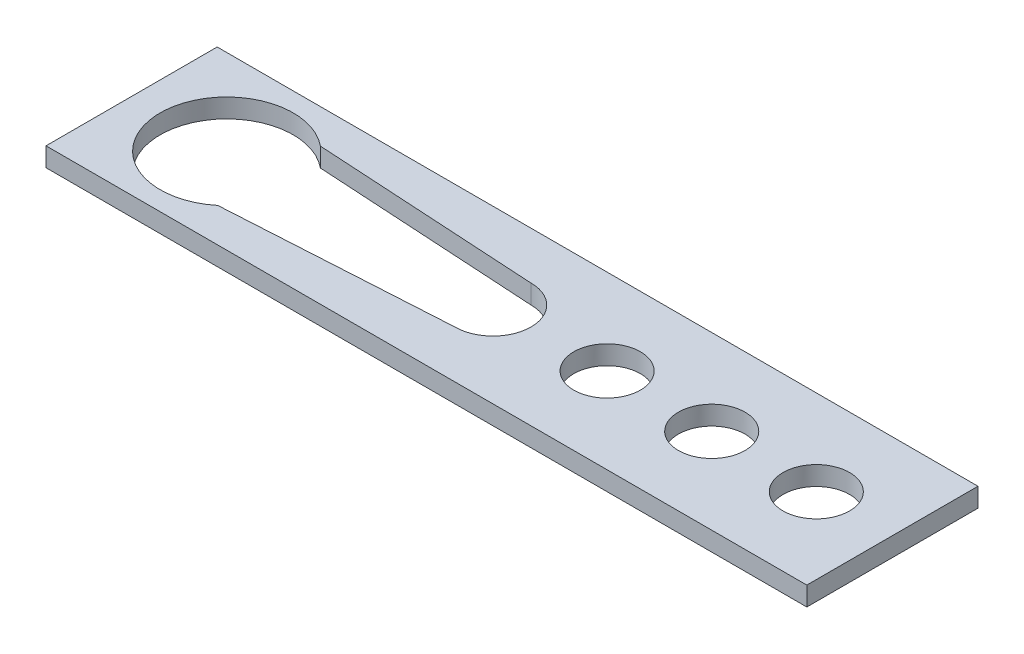
ISO-10303-21;
HEADER;
FILE_DESCRIPTION(('STEP AP214'),'2;1');
FILE_NAME('part.step','',(''),(''),'','','');
FILE_SCHEMA(('AUTOMOTIVE_DESIGN { 1 0 10303 214 1 1 1 1 }'));
ENDSEC;
DATA;
#1=APPLICATION_CONTEXT('core data for automotive mechanical design processes');
#2=APPLICATION_PROTOCOL_DEFINITION('international standard','automotive_design',2000,#1);
#3=PRODUCT_CONTEXT('',#1,'mechanical');
#4=PRODUCT('Part','Part','',(#3));
#5=PRODUCT_RELATED_PRODUCT_CATEGORY('part','',(#4));
#6=PRODUCT_DEFINITION_FORMATION('','',#4);
#7=PRODUCT_DEFINITION_CONTEXT('part definition',#1,'design');
#8=PRODUCT_DEFINITION('design','',#6,#7);
#9=PRODUCT_DEFINITION_SHAPE('','',#8);
#10=(LENGTH_UNIT() NAMED_UNIT(*) SI_UNIT(.MILLI.,.METRE.));
#11=(NAMED_UNIT(*) PLANE_ANGLE_UNIT() SI_UNIT($,.RADIAN.));
#12=(NAMED_UNIT(*) SI_UNIT($,.STERADIAN.) SOLID_ANGLE_UNIT());
#13=UNCERTAINTY_MEASURE_WITH_UNIT(LENGTH_MEASURE(1.E-05),#10,'distance_accuracy_value','');
#14=(GEOMETRIC_REPRESENTATION_CONTEXT(3) GLOBAL_UNCERTAINTY_ASSIGNED_CONTEXT((#13)) GLOBAL_UNIT_ASSIGNED_CONTEXT((#10,
#11,#12)) REPRESENTATION_CONTEXT('',''));
#15=CARTESIAN_POINT('',(0.,0.,0.));
#16=DIRECTION('',(0.,0.,1.));
#17=DIRECTION('',(1.,0.,0.));
#18=AXIS2_PLACEMENT_3D('',#15,#16,#17);
#19=CARTESIAN_POINT('',(16.,-2.,0.));
#20=DIRECTION('',(0.,1.,0.));
#21=DIRECTION('',(0.,0.,1.));
#22=AXIS2_PLACEMENT_3D('',#19,#20,#21);
#23=CYLINDRICAL_SURFACE('',#22,1.75);
#24=CARTESIAN_POINT('',(16.,0.,0.));
#25=DIRECTION('',(0.,-1.,0.));
#26=DIRECTION('',(0.,0.,-1.));
#27=AXIS2_PLACEMENT_3D('',#24,#25,#26);
#28=CIRCLE('',#27,1.75);
#29=CARTESIAN_POINT('',(16.,0.,-1.75));
#30=VERTEX_POINT('',#29);
#31=EDGE_CURVE('E39',#30,#30,#28,.T.);
#32=ORIENTED_EDGE('',*,*,#31,.T.);
#33=EDGE_LOOP('',(#32));
#34=FACE_BOUND('',#33,.T.);
#35=CARTESIAN_POINT('',(16.,1.,0.));
#36=DIRECTION('',(0.,1.,0.));
#37=DIRECTION('',(0.,0.,1.));
#38=AXIS2_PLACEMENT_3D('',#35,#36,#37);
#39=CIRCLE('',#38,1.75);
#40=CARTESIAN_POINT('',(16.,1.,1.75));
#41=VERTEX_POINT('',#40);
#42=EDGE_CURVE('E11',#41,#41,#39,.T.);
#43=ORIENTED_EDGE('',*,*,#42,.T.);
#44=EDGE_LOOP('',(#43));
#45=FACE_BOUND('',#44,.T.);
#46=ADVANCED_FACE('F32',(#34,#45),#23,.F.);
#47=CARTESIAN_POINT('',(20.,1.,4.5));
#48=DIRECTION('',(-1.,0.,0.));
#49=DIRECTION('',(0.,0.,1.));
#50=AXIS2_PLACEMENT_3D('',#47,#48,#49);
#51=PLANE('',#50);
#52=DIRECTION('',(0.,0.,-1.));
#53=VECTOR('',#52,1.);
#54=CARTESIAN_POINT('',(20.,0.,4.5));
#55=LINE('',#54,#53);
#56=CARTESIAN_POINT('',(20.,0.,4.5));
#57=VERTEX_POINT('',#56);
#58=CARTESIAN_POINT('',(20.,0.,-4.5));
#59=VERTEX_POINT('',#58);
#60=EDGE_CURVE('E122',#57,#59,#55,.T.);
#61=ORIENTED_EDGE('',*,*,#60,.T.);
#62=DIRECTION('',(0.,-1.,0.));
#63=VECTOR('',#62,1.);
#64=CARTESIAN_POINT('',(20.,1.,-4.5));
#65=LINE('',#64,#63);
#66=CARTESIAN_POINT('',(20.,1.,-4.5));
#67=VERTEX_POINT('',#66);
#68=EDGE_CURVE('E151',#67,#59,#65,.T.);
#69=ORIENTED_EDGE('',*,*,#68,.F.);
#70=DIRECTION('',(0.,0.,-1.));
#71=VECTOR('',#70,1.);
#72=CARTESIAN_POINT('',(20.,1.,4.5));
#73=LINE('',#72,#71);
#74=CARTESIAN_POINT('',(20.,1.,4.5));
#75=VERTEX_POINT('',#74);
#76=EDGE_CURVE('E125',#75,#67,#73,.T.);
#77=ORIENTED_EDGE('',*,*,#76,.F.);
#78=DIRECTION('',(0.,-1.,0.));
#79=VECTOR('',#78,1.);
#80=CARTESIAN_POINT('',(20.,1.,4.5));
#81=LINE('',#80,#79);
#82=EDGE_CURVE('E135',#75,#57,#81,.T.);
#83=ORIENTED_EDGE('',*,*,#82,.T.);
#84=EDGE_LOOP('',(#61,#69,#77,#83));
#85=FACE_BOUND('',#84,.T.);
#86=ADVANCED_FACE('F187',(#85),#51,.F.);
#87=CARTESIAN_POINT('',(-20.,1.,-4.5));
#88=DIRECTION('',(0.,0.,1.));
#89=DIRECTION('',(1.,0.,0.));
#90=AXIS2_PLACEMENT_3D('',#87,#88,#89);
#91=PLANE('',#90);
#92=DIRECTION('',(-1.,0.,0.));
#93=VECTOR('',#92,1.);
#94=CARTESIAN_POINT('',(-20.,0.,-4.5));
#95=LINE('',#94,#93);
#96=CARTESIAN_POINT('',(-20.,0.,-4.5));
#97=VERTEX_POINT('',#96);
#98=EDGE_CURVE('E138',#59,#97,#95,.T.);
#99=ORIENTED_EDGE('',*,*,#98,.T.);
#100=DIRECTION('',(0.,-1.,0.));
#101=VECTOR('',#100,1.);
#102=CARTESIAN_POINT('',(-20.,1.,-4.5));
#103=LINE('',#102,#101);
#104=CARTESIAN_POINT('',(-20.,1.,-4.5));
#105=VERTEX_POINT('',#104);
#106=EDGE_CURVE('E148',#105,#97,#103,.T.);
#107=ORIENTED_EDGE('',*,*,#106,.F.);
#108=DIRECTION('',(-1.,0.,0.));
#109=VECTOR('',#108,1.);
#110=CARTESIAN_POINT('',(-20.,1.,-4.5));
#111=LINE('',#110,#109);
#112=EDGE_CURVE('E128',#67,#105,#111,.T.);
#113=ORIENTED_EDGE('',*,*,#112,.F.);
#114=ORIENTED_EDGE('',*,*,#68,.T.);
#115=EDGE_LOOP('',(#99,#107,#113,#114));
#116=FACE_BOUND('',#115,.T.);
#117=ADVANCED_FACE('F191',(#116),#91,.F.);
#118=CARTESIAN_POINT('',(-20.,1.,4.5));
#119=DIRECTION('',(1.,0.,0.));
#120=DIRECTION('',(0.,0.,-1.));
#121=AXIS2_PLACEMENT_3D('',#118,#119,#120);
#122=PLANE('',#121);
#123=DIRECTION('',(0.,0.,1.));
#124=VECTOR('',#123,1.);
#125=CARTESIAN_POINT('',(-20.,0.,4.5));
#126=LINE('',#125,#124);
#127=CARTESIAN_POINT('',(-20.,0.,4.5));
#128=VERTEX_POINT('',#127);
#129=EDGE_CURVE('E140',#97,#128,#126,.T.);
#130=ORIENTED_EDGE('',*,*,#129,.T.);
#131=DIRECTION('',(0.,-1.,0.));
#132=VECTOR('',#131,1.);
#133=CARTESIAN_POINT('',(-20.,1.,4.5));
#134=LINE('',#133,#132);
#135=CARTESIAN_POINT('',(-20.,1.,4.5));
#136=VERTEX_POINT('',#135);
#137=EDGE_CURVE('E145',#136,#128,#134,.T.);
#138=ORIENTED_EDGE('',*,*,#137,.F.);
#139=DIRECTION('',(0.,0.,1.));
#140=VECTOR('',#139,1.);
#141=CARTESIAN_POINT('',(-20.,1.,4.5));
#142=LINE('',#141,#140);
#143=EDGE_CURVE('E131',#105,#136,#142,.T.);
#144=ORIENTED_EDGE('',*,*,#143,.F.);
#145=ORIENTED_EDGE('',*,*,#106,.T.);
#146=EDGE_LOOP('',(#130,#138,#144,#145));
#147=FACE_BOUND('',#146,.T.);
#148=ADVANCED_FACE('F196',(#147),#122,.F.);
#149=CARTESIAN_POINT('',(-20.,1.,4.5));
#150=DIRECTION('',(0.,0.,-1.));
#151=DIRECTION('',(-1.,0.,0.));
#152=AXIS2_PLACEMENT_3D('',#149,#150,#151);
#153=PLANE('',#152);
#154=DIRECTION('',(1.,0.,0.));
#155=VECTOR('',#154,1.);
#156=CARTESIAN_POINT('',(-20.,0.,4.5));
#157=LINE('',#156,#155);
#158=EDGE_CURVE('E129',#128,#57,#157,.T.);
#159=ORIENTED_EDGE('',*,*,#158,.T.);
#160=ORIENTED_EDGE('',*,*,#82,.F.);
#161=DIRECTION('',(1.,0.,0.));
#162=VECTOR('',#161,1.);
#163=CARTESIAN_POINT('',(-20.,1.,4.5));
#164=LINE('',#163,#162);
#165=EDGE_CURVE('E133',#136,#75,#164,.T.);
#166=ORIENTED_EDGE('',*,*,#165,.F.);
#167=ORIENTED_EDGE('',*,*,#137,.T.);
#168=EDGE_LOOP('',(#159,#160,#166,#167));
#169=FACE_BOUND('',#168,.T.);
#170=ADVANCED_FACE('F180',(#169),#153,.F.);
#171=CARTESIAN_POINT('',(0.,1.,0.));
#172=DIRECTION('',(0.,-1.,0.));
#173=DIRECTION('',(0.,0.,-1.));
#174=AXIS2_PLACEMENT_3D('',#171,#172,#173);
#175=PLANE('',#174);
#176=CARTESIAN_POINT('',(10.5,1.,0.));
#177=DIRECTION('',(0.,1.,0.));
#178=DIRECTION('',(0.,0.,1.));
#179=AXIS2_PLACEMENT_3D('',#176,#177,#178);
#180=CIRCLE('',#179,1.75);
#181=CARTESIAN_POINT('',(10.5,1.,1.75));
#182=VERTEX_POINT('',#181);
#183=EDGE_CURVE('E295',#182,#182,#180,.T.);
#184=ORIENTED_EDGE('',*,*,#183,.F.);
#185=EDGE_LOOP('',(#184));
#186=FACE_BOUND('',#185,.T.);
#187=CARTESIAN_POINT('',(5.,1.,0.));
#188=DIRECTION('',(0.,1.,0.));
#189=DIRECTION('',(0.,0.,1.));
#190=AXIS2_PLACEMENT_3D('',#187,#188,#189);
#191=CIRCLE('',#190,1.75);
#192=CARTESIAN_POINT('',(5.,1.,1.75));
#193=VERTEX_POINT('',#192);
#194=EDGE_CURVE('E163',#193,#193,#191,.T.);
#195=ORIENTED_EDGE('',*,*,#194,.F.);
#196=EDGE_LOOP('',(#195));
#197=FACE_BOUND('',#196,.T.);
#198=CARTESIAN_POINT('',(-15.,1.,0.));
#199=DIRECTION('',(0.,1.,0.));
#200=DIRECTION('',(0.,0.,1.));
#201=AXIS2_PLACEMENT_3D('',#198,#199,#200);
#202=CIRCLE('',#201,3.5);
#203=CARTESIAN_POINT('',(-12.772894254868,1.,-2.7));
#204=VERTEX_POINT('',#203);
#205=CARTESIAN_POINT('',(-12.772894254868,1.,2.7));
#206=VERTEX_POINT('',#205);
#207=EDGE_CURVE('E108',#204,#206,#202,.T.);
#208=ORIENTED_EDGE('',*,*,#207,.F.);
#209=DIRECTION('',(-0.998237009670938,0.,-0.0593537911444947));
#210=VECTOR('',#209,1.);
#211=CARTESIAN_POINT('',(0.114975429446203,1.,-1.93370510396884));
#212=LINE('',#211,#210);
#213=CARTESIAN_POINT('',(-0.999999999999999,1.,-2.));
#214=VERTEX_POINT('',#213);
#215=EDGE_CURVE('E46',#214,#204,#212,.T.);
#216=ORIENTED_EDGE('',*,*,#215,.F.);
#217=CARTESIAN_POINT('',(-0.999999999999999,1.,0.));
#218=DIRECTION('',(0.,1.,0.));
#219=DIRECTION('',(0.,0.,1.));
#220=AXIS2_PLACEMENT_3D('',#217,#218,#219);
#221=CIRCLE('',#220,2.);
#222=CARTESIAN_POINT('',(-0.999999999999999,1.,2.));
#223=VERTEX_POINT('',#222);
#224=EDGE_CURVE('E115',#223,#214,#221,.T.);
#225=ORIENTED_EDGE('',*,*,#224,.F.);
#226=DIRECTION('',(0.998237009670938,0.,-0.0593537911444947));
#227=VECTOR('',#226,1.);
#228=CARTESIAN_POINT('',(0.114975429446203,1.,1.93370510396884));
#229=LINE('',#228,#227);
#230=EDGE_CURVE('E99',#206,#223,#229,.T.);
#231=ORIENTED_EDGE('',*,*,#230,.F.);
#232=EDGE_LOOP('',(#208,#216,#225,#231));
#233=FACE_BOUND('',#232,.T.);
#234=ORIENTED_EDGE('',*,*,#76,.T.);
#235=ORIENTED_EDGE('',*,*,#112,.T.);
#236=ORIENTED_EDGE('',*,*,#143,.T.);
#237=ORIENTED_EDGE('',*,*,#165,.T.);
#238=EDGE_LOOP('',(#234,#235,#236,#237));
#239=FACE_BOUND('',#238,.T.);
#240=ORIENTED_EDGE('',*,*,#42,.F.);
#241=EDGE_LOOP('',(#240));
#242=FACE_BOUND('',#241,.T.);
#243=ADVANCED_FACE('F112',(#186,#197,#233,#239,#242),#175,.F.);
#244=CARTESIAN_POINT('',(0.,0.,0.));
#245=DIRECTION('',(0.,-1.,0.));
#246=DIRECTION('',(0.,0.,-1.));
#247=AXIS2_PLACEMENT_3D('',#244,#245,#246);
#248=PLANE('',#247);
#249=CARTESIAN_POINT('',(10.5,0.,0.));
#250=DIRECTION('',(0.,-1.,0.));
#251=DIRECTION('',(0.,0.,-1.));
#252=AXIS2_PLACEMENT_3D('',#249,#250,#251);
#253=CIRCLE('',#252,1.75);
#254=CARTESIAN_POINT('',(10.5,0.,-1.75));
#255=VERTEX_POINT('',#254);
#256=EDGE_CURVE('E298',#255,#255,#253,.T.);
#257=ORIENTED_EDGE('',*,*,#256,.F.);
#258=EDGE_LOOP('',(#257));
#259=FACE_BOUND('',#258,.T.);
#260=CARTESIAN_POINT('',(5.,0.,0.));
#261=DIRECTION('',(0.,-1.,0.));
#262=DIRECTION('',(0.,0.,-1.));
#263=AXIS2_PLACEMENT_3D('',#260,#261,#262);
#264=CIRCLE('',#263,1.75);
#265=CARTESIAN_POINT('',(5.,0.,-1.75));
#266=VERTEX_POINT('',#265);
#267=EDGE_CURVE('E161',#266,#266,#264,.T.);
#268=ORIENTED_EDGE('',*,*,#267,.F.);
#269=EDGE_LOOP('',(#268));
#270=FACE_BOUND('',#269,.T.);
#271=DIRECTION('',(0.998237009670938,0.,0.0593537911444947));
#272=VECTOR('',#271,1.);
#273=CARTESIAN_POINT('',(0.114975429446203,0.,-1.93370510396884));
#274=LINE('',#273,#272);
#275=CARTESIAN_POINT('',(-12.772894254868,0.,-2.7));
#276=VERTEX_POINT('',#275);
#277=CARTESIAN_POINT('',(-0.999999999999999,0.,-2.));
#278=VERTEX_POINT('',#277);
#279=EDGE_CURVE('E159',#276,#278,#274,.T.);
#280=ORIENTED_EDGE('',*,*,#279,.F.);
#281=CARTESIAN_POINT('',(-15.,0.,0.));
#282=DIRECTION('',(0.,-1.,0.));
#283=DIRECTION('',(0.,0.,-1.));
#284=AXIS2_PLACEMENT_3D('',#281,#282,#283);
#285=CIRCLE('',#284,3.5);
#286=CARTESIAN_POINT('',(-12.772894254868,0.,2.7));
#287=VERTEX_POINT('',#286);
#288=EDGE_CURVE('E154',#287,#276,#285,.T.);
#289=ORIENTED_EDGE('',*,*,#288,.F.);
#290=DIRECTION('',(-0.998237009670938,0.,0.0593537911444947));
#291=VECTOR('',#290,1.);
#292=CARTESIAN_POINT('',(0.114975429446203,0.,1.93370510396884));
#293=LINE('',#292,#291);
#294=CARTESIAN_POINT('',(-0.999999999999999,0.,2.));
#295=VERTEX_POINT('',#294);
#296=EDGE_CURVE('E102',#295,#287,#293,.T.);
#297=ORIENTED_EDGE('',*,*,#296,.F.);
#298=CARTESIAN_POINT('',(-0.999999999999999,0.,0.));
#299=DIRECTION('',(0.,-1.,0.));
#300=DIRECTION('',(0.,0.,-1.));
#301=AXIS2_PLACEMENT_3D('',#298,#299,#300);
#302=CIRCLE('',#301,2.);
#303=EDGE_CURVE('E157',#278,#295,#302,.T.);
#304=ORIENTED_EDGE('',*,*,#303,.F.);
#305=EDGE_LOOP('',(#280,#289,#297,#304));
#306=FACE_BOUND('',#305,.T.);
#307=ORIENTED_EDGE('',*,*,#60,.F.);
#308=ORIENTED_EDGE('',*,*,#158,.F.);
#309=ORIENTED_EDGE('',*,*,#129,.F.);
#310=ORIENTED_EDGE('',*,*,#98,.F.);
#311=EDGE_LOOP('',(#307,#308,#309,#310));
#312=FACE_BOUND('',#311,.T.);
#313=ORIENTED_EDGE('',*,*,#31,.F.);
#314=EDGE_LOOP('',(#313));
#315=FACE_BOUND('',#314,.T.);
#316=ADVANCED_FACE('F169',(#259,#270,#306,#312,#315),#248,.T.);
#317=CARTESIAN_POINT('',(0.114975429446203,-2.,-1.93370510396884));
#318=DIRECTION('',(0.0593537911444947,0.,-0.998237009670938));
#319=DIRECTION('',(-0.998237009670938,0.,-0.0593537911444947));
#320=AXIS2_PLACEMENT_3D('',#317,#318,#319);
#321=PLANE('',#320);
#322=ORIENTED_EDGE('',*,*,#279,.T.);
#323=DIRECTION('',(0.,1.,0.));
#324=VECTOR('',#323,1.);
#325=CARTESIAN_POINT('',(-0.999999999999999,-2.,-2.));
#326=LINE('',#325,#324);
#327=EDGE_CURVE('E120',#278,#214,#326,.T.);
#328=ORIENTED_EDGE('',*,*,#327,.T.);
#329=ORIENTED_EDGE('',*,*,#215,.T.);
#330=DIRECTION('',(0.,1.,0.));
#331=VECTOR('',#330,1.);
#332=CARTESIAN_POINT('',(-12.772894254868,-2.,-2.7));
#333=LINE('',#332,#331);
#334=EDGE_CURVE('E105',#276,#204,#333,.T.);
#335=ORIENTED_EDGE('',*,*,#334,.F.);
#336=EDGE_LOOP('',(#322,#328,#329,#335));
#337=FACE_BOUND('',#336,.T.);
#338=ADVANCED_FACE('F171',(#337),#321,.F.);
#339=CARTESIAN_POINT('',(-0.999999999999999,-2.,0.));
#340=DIRECTION('',(0.,1.,0.));
#341=DIRECTION('',(0.,0.,1.));
#342=AXIS2_PLACEMENT_3D('',#339,#340,#341);
#343=CYLINDRICAL_SURFACE('',#342,2.);
#344=ORIENTED_EDGE('',*,*,#303,.T.);
#345=DIRECTION('',(0.,1.,0.));
#346=VECTOR('',#345,1.);
#347=CARTESIAN_POINT('',(-0.999999999999999,-2.,2.));
#348=LINE('',#347,#346);
#349=EDGE_CURVE('E104',#295,#223,#348,.T.);
#350=ORIENTED_EDGE('',*,*,#349,.T.);
#351=ORIENTED_EDGE('',*,*,#224,.T.);
#352=ORIENTED_EDGE('',*,*,#327,.F.);
#353=EDGE_LOOP('',(#344,#350,#351,#352));
#354=FACE_BOUND('',#353,.T.);
#355=ADVANCED_FACE('F178',(#354),#343,.F.);
#356=CARTESIAN_POINT('',(0.114975429446203,-2.,1.93370510396884));
#357=DIRECTION('',(0.0593537911444947,0.,0.998237009670938));
#358=DIRECTION('',(0.998237009670938,0.,-0.0593537911444947));
#359=AXIS2_PLACEMENT_3D('',#356,#357,#358);
#360=PLANE('',#359);
#361=ORIENTED_EDGE('',*,*,#296,.T.);
#362=DIRECTION('',(0.,1.,0.));
#363=VECTOR('',#362,1.);
#364=CARTESIAN_POINT('',(-12.772894254868,-2.,2.7));
#365=LINE('',#364,#363);
#366=EDGE_CURVE('E54',#287,#206,#365,.T.);
#367=ORIENTED_EDGE('',*,*,#366,.T.);
#368=ORIENTED_EDGE('',*,*,#230,.T.);
#369=ORIENTED_EDGE('',*,*,#349,.F.);
#370=EDGE_LOOP('',(#361,#367,#368,#369));
#371=FACE_BOUND('',#370,.T.);
#372=ADVANCED_FACE('F96',(#371),#360,.F.);
#373=CARTESIAN_POINT('',(-15.,-2.,0.));
#374=DIRECTION('',(0.,1.,0.));
#375=DIRECTION('',(0.,0.,1.));
#376=AXIS2_PLACEMENT_3D('',#373,#374,#375);
#377=CYLINDRICAL_SURFACE('',#376,3.5);
#378=ORIENTED_EDGE('',*,*,#288,.T.);
#379=ORIENTED_EDGE('',*,*,#334,.T.);
#380=ORIENTED_EDGE('',*,*,#207,.T.);
#381=ORIENTED_EDGE('',*,*,#366,.F.);
#382=EDGE_LOOP('',(#378,#379,#380,#381));
#383=FACE_BOUND('',#382,.T.);
#384=ADVANCED_FACE('F109',(#383),#377,.F.);
#385=CARTESIAN_POINT('',(5.,-2.,0.));
#386=DIRECTION('',(0.,1.,0.));
#387=DIRECTION('',(0.,0.,1.));
#388=AXIS2_PLACEMENT_3D('',#385,#386,#387);
#389=CYLINDRICAL_SURFACE('',#388,1.75);
#390=ORIENTED_EDGE('',*,*,#267,.T.);
#391=EDGE_LOOP('',(#390));
#392=FACE_BOUND('',#391,.T.);
#393=ORIENTED_EDGE('',*,*,#194,.T.);
#394=EDGE_LOOP('',(#393));
#395=FACE_BOUND('',#394,.T.);
#396=ADVANCED_FACE('F243',(#392,#395),#389,.F.);
#397=CARTESIAN_POINT('',(10.5,-2.,0.));
#398=DIRECTION('',(0.,1.,0.));
#399=DIRECTION('',(0.,0.,1.));
#400=AXIS2_PLACEMENT_3D('',#397,#398,#399);
#401=CYLINDRICAL_SURFACE('',#400,1.75);
#402=ORIENTED_EDGE('',*,*,#256,.T.);
#403=EDGE_LOOP('',(#402));
#404=FACE_BOUND('',#403,.T.);
#405=ORIENTED_EDGE('',*,*,#183,.T.);
#406=EDGE_LOOP('',(#405));
#407=FACE_BOUND('',#406,.T.);
#408=ADVANCED_FACE('F239',(#404,#407),#401,.F.);
#409=CLOSED_SHELL('',(#46,#86,#117,#148,#170,#243,#316,#338,#355,#372,#384,#396,#408));
#410=MANIFOLD_SOLID_BREP('B2',#409);
#411=ADVANCED_BREP_SHAPE_REPRESENTATION('',(#18,#410),#14);
#412=SHAPE_DEFINITION_REPRESENTATION(#9,#411);
ENDSEC;
END-ISO-10303-21;
